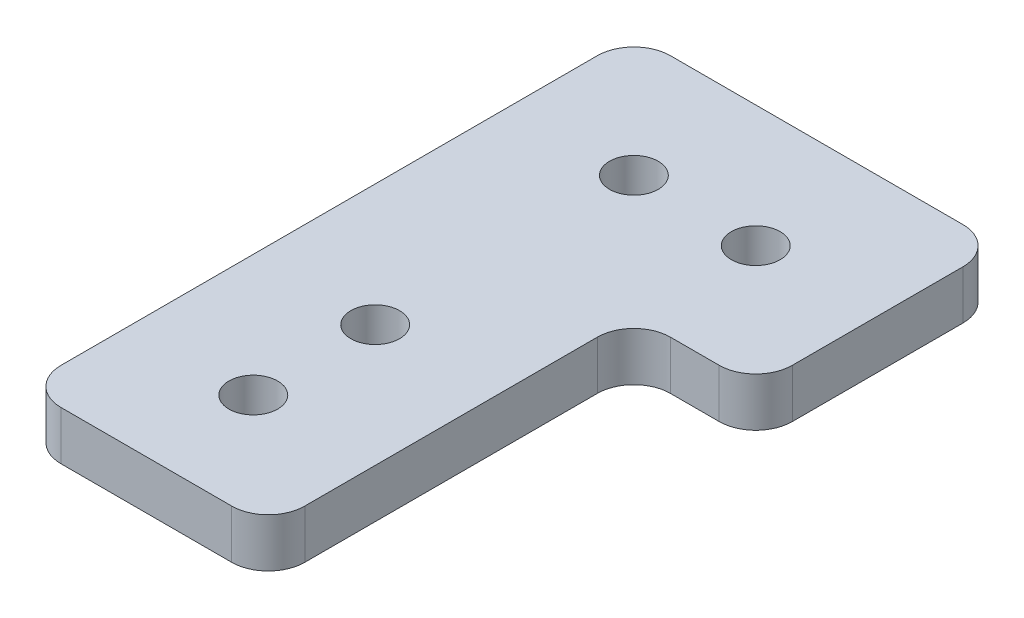
ISO-10303-21;
HEADER;
FILE_DESCRIPTION(('STEP AP214'),'2;1');
FILE_NAME('part.step','',(''),(''),'','','');
FILE_SCHEMA(('AUTOMOTIVE_DESIGN { 1 0 10303 214 1 1 1 1 }'));
ENDSEC;
DATA;
#1=APPLICATION_CONTEXT('core data for automotive mechanical design processes');
#2=APPLICATION_PROTOCOL_DEFINITION('international standard','automotive_design',2000,#1);
#3=PRODUCT_CONTEXT('',#1,'mechanical');
#4=PRODUCT('Part','Part','',(#3));
#5=PRODUCT_RELATED_PRODUCT_CATEGORY('part','',(#4));
#6=PRODUCT_DEFINITION_FORMATION('','',#4);
#7=PRODUCT_DEFINITION_CONTEXT('part definition',#1,'design');
#8=PRODUCT_DEFINITION('design','',#6,#7);
#9=PRODUCT_DEFINITION_SHAPE('','',#8);
#10=(LENGTH_UNIT() NAMED_UNIT(*) SI_UNIT(.MILLI.,.METRE.));
#11=(NAMED_UNIT(*) PLANE_ANGLE_UNIT() SI_UNIT($,.RADIAN.));
#12=(NAMED_UNIT(*) SI_UNIT($,.STERADIAN.) SOLID_ANGLE_UNIT());
#13=UNCERTAINTY_MEASURE_WITH_UNIT(LENGTH_MEASURE(1.E-05),#10,'distance_accuracy_value','');
#14=(GEOMETRIC_REPRESENTATION_CONTEXT(3) GLOBAL_UNCERTAINTY_ASSIGNED_CONTEXT((#13)) GLOBAL_UNIT_ASSIGNED_CONTEXT((#10,
#11,#12)) REPRESENTATION_CONTEXT('',''));
#15=CARTESIAN_POINT('',(0.,0.,0.));
#16=DIRECTION('',(0.,0.,1.));
#17=DIRECTION('',(1.,0.,0.));
#18=AXIS2_PLACEMENT_3D('',#15,#16,#17);
#19=CARTESIAN_POINT('',(0.,4.,0.));
#20=DIRECTION('',(0.,1.,0.));
#21=DIRECTION('',(0.,0.,1.));
#22=AXIS2_PLACEMENT_3D('',#19,#20,#21);
#23=PLANE('',#22);
#24=CARTESIAN_POINT('',(20.,4.,-40.));
#25=DIRECTION('',(0.,1.,0.));
#26=DIRECTION('',(0.,0.,1.));
#27=AXIS2_PLACEMENT_3D('',#24,#25,#26);
#28=CIRCLE('',#27,2.00000000000001);
#29=CARTESIAN_POINT('',(20.,4.,-38.));
#30=VERTEX_POINT('',#29);
#31=EDGE_CURVE('E244',#30,#30,#28,.T.);
#32=ORIENTED_EDGE('',*,*,#31,.F.);
#33=EDGE_LOOP('',(#32));
#34=FACE_BOUND('',#33,.T.);
#35=CARTESIAN_POINT('',(10.,4.,-18.7732277592817));
#36=DIRECTION('',(0.,1.,0.));
#37=DIRECTION('',(0.,0.,1.));
#38=AXIS2_PLACEMENT_3D('',#35,#36,#37);
#39=CIRCLE('',#38,2.);
#40=CARTESIAN_POINT('',(10.,4.,-16.7732277592817));
#41=VERTEX_POINT('',#40);
#42=EDGE_CURVE('E152',#41,#41,#39,.T.);
#43=ORIENTED_EDGE('',*,*,#42,.F.);
#44=EDGE_LOOP('',(#43));
#45=FACE_BOUND('',#44,.T.);
#46=DIRECTION('',(-1.,0.,0.));
#47=VECTOR('',#46,1.);
#48=CARTESIAN_POINT('',(30.,4.,-50.));
#49=LINE('',#48,#47);
#50=CARTESIAN_POINT('',(27.,4.,-50.));
#51=VERTEX_POINT('',#50);
#52=CARTESIAN_POINT('',(3.,4.,-50.));
#53=VERTEX_POINT('',#52);
#54=EDGE_CURVE('E161',#51,#53,#49,.T.);
#55=ORIENTED_EDGE('',*,*,#54,.T.);
#56=CARTESIAN_POINT('',(3.,4.,-47.));
#57=DIRECTION('',(0.,1.,0.));
#58=DIRECTION('',(0.,0.,1.));
#59=AXIS2_PLACEMENT_3D('',#56,#57,#58);
#60=CIRCLE('',#59,3.);
#61=CARTESIAN_POINT('',(0.,4.,-47.));
#62=VERTEX_POINT('',#61);
#63=EDGE_CURVE('E190',#53,#62,#60,.T.);
#64=ORIENTED_EDGE('',*,*,#63,.T.);
#65=DIRECTION('',(0.,0.,1.));
#66=VECTOR('',#65,1.);
#67=CARTESIAN_POINT('',(0.,4.,-50.));
#68=LINE('',#67,#66);
#69=CARTESIAN_POINT('',(0.,4.,-3.));
#70=VERTEX_POINT('',#69);
#71=EDGE_CURVE('E144',#62,#70,#68,.T.);
#72=ORIENTED_EDGE('',*,*,#71,.T.);
#73=CARTESIAN_POINT('',(3.,4.,-3.));
#74=DIRECTION('',(0.,1.,0.));
#75=DIRECTION('',(0.,0.,1.));
#76=AXIS2_PLACEMENT_3D('',#73,#74,#75);
#77=CIRCLE('',#76,3.);
#78=CARTESIAN_POINT('',(3.,4.,0.));
#79=VERTEX_POINT('',#78);
#80=EDGE_CURVE('E183',#70,#79,#77,.T.);
#81=ORIENTED_EDGE('',*,*,#80,.T.);
#82=DIRECTION('',(1.,0.,0.));
#83=VECTOR('',#82,1.);
#84=CARTESIAN_POINT('',(0.,4.,0.));
#85=LINE('',#84,#83);
#86=CARTESIAN_POINT('',(17.,4.,0.));
#87=VERTEX_POINT('',#86);
#88=EDGE_CURVE('E232',#79,#87,#85,.T.);
#89=ORIENTED_EDGE('',*,*,#88,.T.);
#90=CARTESIAN_POINT('',(17.,4.,-3.));
#91=DIRECTION('',(0.,1.,0.));
#92=DIRECTION('',(0.,0.,1.));
#93=AXIS2_PLACEMENT_3D('',#90,#91,#92);
#94=CIRCLE('',#93,3.);
#95=CARTESIAN_POINT('',(20.,4.,-3.));
#96=VERTEX_POINT('',#95);
#97=EDGE_CURVE('E185',#87,#96,#94,.T.);
#98=ORIENTED_EDGE('',*,*,#97,.T.);
#99=DIRECTION('',(0.,0.,-1.));
#100=VECTOR('',#99,1.);
#101=CARTESIAN_POINT('',(20.,4.,0.));
#102=LINE('',#101,#100);
#103=CARTESIAN_POINT('',(20.,4.,-27.));
#104=VERTEX_POINT('',#103);
#105=EDGE_CURVE('E226',#96,#104,#102,.T.);
#106=ORIENTED_EDGE('',*,*,#105,.T.);
#107=CARTESIAN_POINT('',(23.,4.,-27.));
#108=DIRECTION('',(0.,1.,0.));
#109=DIRECTION('',(0.,0.,1.));
#110=AXIS2_PLACEMENT_3D('',#107,#108,#109);
#111=CIRCLE('',#110,3.);
#112=CARTESIAN_POINT('',(23.,4.,-30.));
#113=VERTEX_POINT('',#112);
#114=EDGE_CURVE('E11',#104,#113,#111,.F.);
#115=ORIENTED_EDGE('',*,*,#114,.T.);
#116=DIRECTION('',(1.,0.,0.));
#117=VECTOR('',#116,1.);
#118=CARTESIAN_POINT('',(20.,4.,-30.));
#119=LINE('',#118,#117);
#120=CARTESIAN_POINT('',(27.,4.,-30.));
#121=VERTEX_POINT('',#120);
#122=EDGE_CURVE('E225',#113,#121,#119,.T.);
#123=ORIENTED_EDGE('',*,*,#122,.T.);
#124=CARTESIAN_POINT('',(27.,4.,-33.));
#125=DIRECTION('',(0.,1.,0.));
#126=DIRECTION('',(0.,0.,1.));
#127=AXIS2_PLACEMENT_3D('',#124,#125,#126);
#128=CIRCLE('',#127,3.);
#129=CARTESIAN_POINT('',(30.,4.,-33.));
#130=VERTEX_POINT('',#129);
#131=EDGE_CURVE('E56',#121,#130,#128,.T.);
#132=ORIENTED_EDGE('',*,*,#131,.T.);
#133=DIRECTION('',(0.,0.,-1.));
#134=VECTOR('',#133,1.);
#135=CARTESIAN_POINT('',(30.,4.,-30.));
#136=LINE('',#135,#134);
#137=CARTESIAN_POINT('',(30.,4.,-47.));
#138=VERTEX_POINT('',#137);
#139=EDGE_CURVE('E230',#130,#138,#136,.T.);
#140=ORIENTED_EDGE('',*,*,#139,.T.);
#141=CARTESIAN_POINT('',(27.,4.,-47.));
#142=DIRECTION('',(0.,1.,0.));
#143=DIRECTION('',(0.,0.,1.));
#144=AXIS2_PLACEMENT_3D('',#141,#142,#143);
#145=CIRCLE('',#144,3.);
#146=EDGE_CURVE('E188',#138,#51,#145,.T.);
#147=ORIENTED_EDGE('',*,*,#146,.T.);
#148=EDGE_LOOP('',(#55,#64,#72,#81,#89,#98,#106,#115,#123,#132,#140,#147));
#149=FACE_BOUND('',#148,.T.);
#150=CARTESIAN_POINT('',(10.,4.,-8.77322775928174));
#151=DIRECTION('',(0.,1.,0.));
#152=DIRECTION('',(0.,0.,1.));
#153=AXIS2_PLACEMENT_3D('',#150,#151,#152);
#154=CIRCLE('',#153,2.);
#155=CARTESIAN_POINT('',(10.,4.,-6.77322775928174));
#156=VERTEX_POINT('',#155);
#157=EDGE_CURVE('E239',#156,#156,#154,.T.);
#158=ORIENTED_EDGE('',*,*,#157,.F.);
#159=EDGE_LOOP('',(#158));
#160=FACE_BOUND('',#159,.T.);
#161=CARTESIAN_POINT('',(10.,4.,-40.));
#162=DIRECTION('',(0.,1.,0.));
#163=DIRECTION('',(0.,0.,1.));
#164=AXIS2_PLACEMENT_3D('',#161,#162,#163);
#165=CIRCLE('',#164,2.);
#166=CARTESIAN_POINT('',(10.,4.,-38.));
#167=VERTEX_POINT('',#166);
#168=EDGE_CURVE('E250',#167,#167,#165,.T.);
#169=ORIENTED_EDGE('',*,*,#168,.F.);
#170=EDGE_LOOP('',(#169));
#171=FACE_BOUND('',#170,.T.);
#172=ADVANCED_FACE('F34',(#34,#45,#149,#160,#171),#23,.T.);
#173=CARTESIAN_POINT('',(0.,0.,0.));
#174=DIRECTION('',(0.,1.,0.));
#175=DIRECTION('',(0.,0.,1.));
#176=AXIS2_PLACEMENT_3D('',#173,#174,#175);
#177=PLANE('',#176);
#178=DIRECTION('',(0.,0.,1.));
#179=VECTOR('',#178,1.);
#180=CARTESIAN_POINT('',(0.,0.,-50.));
#181=LINE('',#180,#179);
#182=CARTESIAN_POINT('',(0.,0.,-47.));
#183=VERTEX_POINT('',#182);
#184=CARTESIAN_POINT('',(0.,0.,-3.));
#185=VERTEX_POINT('',#184);
#186=EDGE_CURVE('E141',#183,#185,#181,.T.);
#187=ORIENTED_EDGE('',*,*,#186,.F.);
#188=CARTESIAN_POINT('',(3.,0.,-47.));
#189=DIRECTION('',(0.,1.,0.));
#190=DIRECTION('',(0.,0.,1.));
#191=AXIS2_PLACEMENT_3D('',#188,#189,#190);
#192=CIRCLE('',#191,3.);
#193=CARTESIAN_POINT('',(3.,0.,-50.));
#194=VERTEX_POINT('',#193);
#195=EDGE_CURVE('E124',#183,#194,#192,.F.);
#196=ORIENTED_EDGE('',*,*,#195,.T.);
#197=DIRECTION('',(-1.,0.,0.));
#198=VECTOR('',#197,1.);
#199=CARTESIAN_POINT('',(30.,0.,-50.));
#200=LINE('',#199,#198);
#201=CARTESIAN_POINT('',(27.,0.,-50.));
#202=VERTEX_POINT('',#201);
#203=EDGE_CURVE('E171',#202,#194,#200,.T.);
#204=ORIENTED_EDGE('',*,*,#203,.F.);
#205=CARTESIAN_POINT('',(27.,0.,-47.));
#206=DIRECTION('',(0.,1.,0.));
#207=DIRECTION('',(0.,0.,1.));
#208=AXIS2_PLACEMENT_3D('',#205,#206,#207);
#209=CIRCLE('',#208,3.);
#210=CARTESIAN_POINT('',(30.,0.,-47.));
#211=VERTEX_POINT('',#210);
#212=EDGE_CURVE('E135',#202,#211,#209,.F.);
#213=ORIENTED_EDGE('',*,*,#212,.T.);
#214=DIRECTION('',(0.,0.,-1.));
#215=VECTOR('',#214,1.);
#216=CARTESIAN_POINT('',(30.,0.,-30.));
#217=LINE('',#216,#215);
#218=CARTESIAN_POINT('',(30.,0.,-33.));
#219=VERTEX_POINT('',#218);
#220=EDGE_CURVE('E169',#219,#211,#217,.T.);
#221=ORIENTED_EDGE('',*,*,#220,.F.);
#222=CARTESIAN_POINT('',(27.,0.,-33.));
#223=DIRECTION('',(0.,1.,0.));
#224=DIRECTION('',(0.,0.,1.));
#225=AXIS2_PLACEMENT_3D('',#222,#223,#224);
#226=CIRCLE('',#225,3.);
#227=CARTESIAN_POINT('',(27.,0.,-30.));
#228=VERTEX_POINT('',#227);
#229=EDGE_CURVE('E177',#219,#228,#226,.F.);
#230=ORIENTED_EDGE('',*,*,#229,.T.);
#231=DIRECTION('',(1.,0.,0.));
#232=VECTOR('',#231,1.);
#233=CARTESIAN_POINT('',(20.,0.,-30.));
#234=LINE('',#233,#232);
#235=CARTESIAN_POINT('',(23.,0.,-30.));
#236=VERTEX_POINT('',#235);
#237=EDGE_CURVE('E166',#236,#228,#234,.T.);
#238=ORIENTED_EDGE('',*,*,#237,.F.);
#239=CARTESIAN_POINT('',(23.,0.,-27.));
#240=DIRECTION('',(0.,1.,0.));
#241=DIRECTION('',(0.,0.,1.));
#242=AXIS2_PLACEMENT_3D('',#239,#240,#241);
#243=CIRCLE('',#242,3.);
#244=CARTESIAN_POINT('',(20.,0.,-27.));
#245=VERTEX_POINT('',#244);
#246=EDGE_CURVE('E42',#236,#245,#243,.T.);
#247=ORIENTED_EDGE('',*,*,#246,.T.);
#248=DIRECTION('',(0.,0.,-1.));
#249=VECTOR('',#248,1.);
#250=CARTESIAN_POINT('',(20.,0.,0.));
#251=LINE('',#250,#249);
#252=CARTESIAN_POINT('',(20.,0.,-3.));
#253=VERTEX_POINT('',#252);
#254=EDGE_CURVE('E155',#253,#245,#251,.T.);
#255=ORIENTED_EDGE('',*,*,#254,.F.);
#256=CARTESIAN_POINT('',(17.,0.,-3.));
#257=DIRECTION('',(0.,1.,0.));
#258=DIRECTION('',(0.,0.,1.));
#259=AXIS2_PLACEMENT_3D('',#256,#257,#258);
#260=CIRCLE('',#259,3.);
#261=CARTESIAN_POINT('',(17.,0.,0.));
#262=VERTEX_POINT('',#261);
#263=EDGE_CURVE('E175',#253,#262,#260,.F.);
#264=ORIENTED_EDGE('',*,*,#263,.T.);
#265=DIRECTION('',(1.,0.,0.));
#266=VECTOR('',#265,1.);
#267=CARTESIAN_POINT('',(0.,0.,0.));
#268=LINE('',#267,#266);
#269=CARTESIAN_POINT('',(3.,0.,0.));
#270=VERTEX_POINT('',#269);
#271=EDGE_CURVE('E151',#270,#262,#268,.T.);
#272=ORIENTED_EDGE('',*,*,#271,.F.);
#273=CARTESIAN_POINT('',(3.,0.,-3.));
#274=DIRECTION('',(0.,1.,0.));
#275=DIRECTION('',(0.,0.,1.));
#276=AXIS2_PLACEMENT_3D('',#273,#274,#275);
#277=CIRCLE('',#276,3.);
#278=EDGE_CURVE('E145',#270,#185,#277,.F.);
#279=ORIENTED_EDGE('',*,*,#278,.T.);
#280=EDGE_LOOP('',(#187,#196,#204,#213,#221,#230,#238,#247,#255,#264,#272,#279));
#281=FACE_BOUND('',#280,.T.);
#282=CARTESIAN_POINT('',(10.,0.,-18.7732277592817));
#283=DIRECTION('',(0.,1.,0.));
#284=DIRECTION('',(0.,0.,1.));
#285=AXIS2_PLACEMENT_3D('',#282,#283,#284);
#286=CIRCLE('',#285,2.);
#287=CARTESIAN_POINT('',(10.,0.,-16.7732277592817));
#288=VERTEX_POINT('',#287);
#289=EDGE_CURVE('E158',#288,#288,#286,.T.);
#290=ORIENTED_EDGE('',*,*,#289,.T.);
#291=EDGE_LOOP('',(#290));
#292=FACE_BOUND('',#291,.T.);
#293=CARTESIAN_POINT('',(10.,0.,-8.77322775928174));
#294=DIRECTION('',(0.,1.,0.));
#295=DIRECTION('',(0.,0.,1.));
#296=AXIS2_PLACEMENT_3D('',#293,#294,#295);
#297=CIRCLE('',#296,2.);
#298=CARTESIAN_POINT('',(10.,0.,-6.77322775928174));
#299=VERTEX_POINT('',#298);
#300=EDGE_CURVE('E241',#299,#299,#297,.T.);
#301=ORIENTED_EDGE('',*,*,#300,.T.);
#302=EDGE_LOOP('',(#301));
#303=FACE_BOUND('',#302,.T.);
#304=CARTESIAN_POINT('',(20.,0.,-40.));
#305=DIRECTION('',(0.,1.,0.));
#306=DIRECTION('',(0.,0.,1.));
#307=AXIS2_PLACEMENT_3D('',#304,#305,#306);
#308=CIRCLE('',#307,2.00000000000001);
#309=CARTESIAN_POINT('',(20.,0.,-38.));
#310=VERTEX_POINT('',#309);
#311=EDGE_CURVE('E247',#310,#310,#308,.T.);
#312=ORIENTED_EDGE('',*,*,#311,.T.);
#313=EDGE_LOOP('',(#312));
#314=FACE_BOUND('',#313,.T.);
#315=CARTESIAN_POINT('',(10.,0.,-40.));
#316=DIRECTION('',(0.,1.,0.));
#317=DIRECTION('',(0.,0.,1.));
#318=AXIS2_PLACEMENT_3D('',#315,#316,#317);
#319=CIRCLE('',#318,2.);
#320=CARTESIAN_POINT('',(10.,0.,-38.));
#321=VERTEX_POINT('',#320);
#322=EDGE_CURVE('E253',#321,#321,#319,.T.);
#323=ORIENTED_EDGE('',*,*,#322,.T.);
#324=EDGE_LOOP('',(#323));
#325=FACE_BOUND('',#324,.T.);
#326=ADVANCED_FACE('F148',(#281,#292,#303,#314,#325),#177,.F.);
#327=CARTESIAN_POINT('',(0.,4.,-50.));
#328=DIRECTION('',(1.,0.,0.));
#329=DIRECTION('',(0.,0.,-1.));
#330=AXIS2_PLACEMENT_3D('',#327,#328,#329);
#331=PLANE('',#330);
#332=ORIENTED_EDGE('',*,*,#71,.F.);
#333=DIRECTION('',(0.,-1.,0.));
#334=VECTOR('',#333,1.);
#335=CARTESIAN_POINT('',(0.,4.,-47.));
#336=LINE('',#335,#334);
#337=EDGE_CURVE('E128',#62,#183,#336,.T.);
#338=ORIENTED_EDGE('',*,*,#337,.T.);
#339=ORIENTED_EDGE('',*,*,#186,.T.);
#340=DIRECTION('',(0.,-1.,0.));
#341=VECTOR('',#340,1.);
#342=CARTESIAN_POINT('',(0.,4.,-3.));
#343=LINE('',#342,#341);
#344=EDGE_CURVE('E146',#185,#70,#343,.F.);
#345=ORIENTED_EDGE('',*,*,#344,.T.);
#346=EDGE_LOOP('',(#332,#338,#339,#345));
#347=FACE_BOUND('',#346,.T.);
#348=ADVANCED_FACE('F140',(#347),#331,.F.);
#349=CARTESIAN_POINT('',(0.,4.,0.));
#350=DIRECTION('',(0.,0.,-1.));
#351=DIRECTION('',(-1.,0.,0.));
#352=AXIS2_PLACEMENT_3D('',#349,#350,#351);
#353=PLANE('',#352);
#354=ORIENTED_EDGE('',*,*,#271,.T.);
#355=DIRECTION('',(0.,-1.,0.));
#356=VECTOR('',#355,1.);
#357=CARTESIAN_POINT('',(17.,4.,0.));
#358=LINE('',#357,#356);
#359=EDGE_CURVE('E209',#262,#87,#358,.F.);
#360=ORIENTED_EDGE('',*,*,#359,.T.);
#361=ORIENTED_EDGE('',*,*,#88,.F.);
#362=DIRECTION('',(0.,-1.,0.));
#363=VECTOR('',#362,1.);
#364=CARTESIAN_POINT('',(3.,4.,0.));
#365=LINE('',#364,#363);
#366=EDGE_CURVE('E206',#79,#270,#365,.T.);
#367=ORIENTED_EDGE('',*,*,#366,.T.);
#368=EDGE_LOOP('',(#354,#360,#361,#367));
#369=FACE_BOUND('',#368,.T.);
#370=ADVANCED_FACE('F286',(#369),#353,.F.);
#371=CARTESIAN_POINT('',(20.,4.,0.));
#372=DIRECTION('',(-1.,0.,0.));
#373=DIRECTION('',(0.,0.,1.));
#374=AXIS2_PLACEMENT_3D('',#371,#372,#373);
#375=PLANE('',#374);
#376=ORIENTED_EDGE('',*,*,#254,.T.);
#377=DIRECTION('',(0.,-1.,0.));
#378=VECTOR('',#377,1.);
#379=CARTESIAN_POINT('',(20.,4.,-27.));
#380=LINE('',#379,#378);
#381=EDGE_CURVE('E204',#245,#104,#380,.F.);
#382=ORIENTED_EDGE('',*,*,#381,.T.);
#383=ORIENTED_EDGE('',*,*,#105,.F.);
#384=DIRECTION('',(0.,-1.,0.));
#385=VECTOR('',#384,1.);
#386=CARTESIAN_POINT('',(20.,4.,-3.));
#387=LINE('',#386,#385);
#388=EDGE_CURVE('E201',#96,#253,#387,.T.);
#389=ORIENTED_EDGE('',*,*,#388,.T.);
#390=EDGE_LOOP('',(#376,#382,#383,#389));
#391=FACE_BOUND('',#390,.T.);
#392=ADVANCED_FACE('F216',(#391),#375,.F.);
#393=CARTESIAN_POINT('',(20.,4.,-30.));
#394=DIRECTION('',(0.,0.,-1.));
#395=DIRECTION('',(-1.,0.,0.));
#396=AXIS2_PLACEMENT_3D('',#393,#394,#395);
#397=PLANE('',#396);
#398=ORIENTED_EDGE('',*,*,#237,.T.);
#399=DIRECTION('',(0.,-1.,0.));
#400=VECTOR('',#399,1.);
#401=CARTESIAN_POINT('',(27.,4.,-30.));
#402=LINE('',#401,#400);
#403=EDGE_CURVE('E199',#228,#121,#402,.F.);
#404=ORIENTED_EDGE('',*,*,#403,.T.);
#405=ORIENTED_EDGE('',*,*,#122,.F.);
#406=DIRECTION('',(0.,-1.,0.));
#407=VECTOR('',#406,1.);
#408=CARTESIAN_POINT('',(23.,0.,-30.));
#409=LINE('',#408,#407);
#410=EDGE_CURVE('E196',#113,#236,#409,.T.);
#411=ORIENTED_EDGE('',*,*,#410,.T.);
#412=EDGE_LOOP('',(#398,#404,#405,#411));
#413=FACE_BOUND('',#412,.T.);
#414=ADVANCED_FACE('F228',(#413),#397,.F.);
#415=CARTESIAN_POINT('',(30.,4.,-30.));
#416=DIRECTION('',(-1.,0.,0.));
#417=DIRECTION('',(0.,0.,1.));
#418=AXIS2_PLACEMENT_3D('',#415,#416,#417);
#419=PLANE('',#418);
#420=ORIENTED_EDGE('',*,*,#220,.T.);
#421=DIRECTION('',(0.,-1.,0.));
#422=VECTOR('',#421,1.);
#423=CARTESIAN_POINT('',(30.,4.,-47.));
#424=LINE('',#423,#422);
#425=EDGE_CURVE('E49',#211,#138,#424,.F.);
#426=ORIENTED_EDGE('',*,*,#425,.T.);
#427=ORIENTED_EDGE('',*,*,#139,.F.);
#428=DIRECTION('',(0.,-1.,0.));
#429=VECTOR('',#428,1.);
#430=CARTESIAN_POINT('',(30.,4.,-33.));
#431=LINE('',#430,#429);
#432=EDGE_CURVE('E192',#130,#219,#431,.T.);
#433=ORIENTED_EDGE('',*,*,#432,.T.);
#434=EDGE_LOOP('',(#420,#426,#427,#433));
#435=FACE_BOUND('',#434,.T.);
#436=ADVANCED_FACE('F278',(#435),#419,.F.);
#437=CARTESIAN_POINT('',(30.,4.,-50.));
#438=DIRECTION('',(0.,0.,1.));
#439=DIRECTION('',(1.,0.,0.));
#440=AXIS2_PLACEMENT_3D('',#437,#438,#439);
#441=PLANE('',#440);
#442=ORIENTED_EDGE('',*,*,#203,.T.);
#443=DIRECTION('',(0.,-1.,0.));
#444=VECTOR('',#443,1.);
#445=CARTESIAN_POINT('',(3.,4.,-50.));
#446=LINE('',#445,#444);
#447=EDGE_CURVE('E129',#194,#53,#446,.F.);
#448=ORIENTED_EDGE('',*,*,#447,.T.);
#449=ORIENTED_EDGE('',*,*,#54,.F.);
#450=DIRECTION('',(0.,-1.,0.));
#451=VECTOR('',#450,1.);
#452=CARTESIAN_POINT('',(27.,4.,-50.));
#453=LINE('',#452,#451);
#454=EDGE_CURVE('E134',#51,#202,#453,.T.);
#455=ORIENTED_EDGE('',*,*,#454,.T.);
#456=EDGE_LOOP('',(#442,#448,#449,#455));
#457=FACE_BOUND('',#456,.T.);
#458=ADVANCED_FACE('F275',(#457),#441,.F.);
#459=CARTESIAN_POINT('',(10.,4.,-18.7732277592817));
#460=DIRECTION('',(0.,-1.,0.));
#461=DIRECTION('',(0.,0.,-1.));
#462=AXIS2_PLACEMENT_3D('',#459,#460,#461);
#463=CYLINDRICAL_SURFACE('',#462,2.);
#464=ORIENTED_EDGE('',*,*,#42,.T.);
#465=EDGE_LOOP('',(#464));
#466=FACE_BOUND('',#465,.T.);
#467=ORIENTED_EDGE('',*,*,#289,.F.);
#468=EDGE_LOOP('',(#467));
#469=FACE_BOUND('',#468,.T.);
#470=ADVANCED_FACE('F272',(#466,#469),#463,.F.);
#471=CARTESIAN_POINT('',(10.,4.,-8.77322775928174));
#472=DIRECTION('',(0.,-1.,0.));
#473=DIRECTION('',(0.,0.,-1.));
#474=AXIS2_PLACEMENT_3D('',#471,#472,#473);
#475=CYLINDRICAL_SURFACE('',#474,2.);
#476=ORIENTED_EDGE('',*,*,#157,.T.);
#477=EDGE_LOOP('',(#476));
#478=FACE_BOUND('',#477,.T.);
#479=ORIENTED_EDGE('',*,*,#300,.F.);
#480=EDGE_LOOP('',(#479));
#481=FACE_BOUND('',#480,.T.);
#482=ADVANCED_FACE('F416',(#478,#481),#475,.F.);
#483=CARTESIAN_POINT('',(20.,4.,-40.));
#484=DIRECTION('',(0.,-1.,0.));
#485=DIRECTION('',(0.,0.,-1.));
#486=AXIS2_PLACEMENT_3D('',#483,#484,#485);
#487=CYLINDRICAL_SURFACE('',#486,2.00000000000001);
#488=ORIENTED_EDGE('',*,*,#31,.T.);
#489=EDGE_LOOP('',(#488));
#490=FACE_BOUND('',#489,.T.);
#491=ORIENTED_EDGE('',*,*,#311,.F.);
#492=EDGE_LOOP('',(#491));
#493=FACE_BOUND('',#492,.T.);
#494=ADVANCED_FACE('F407',(#490,#493),#487,.F.);
#495=CARTESIAN_POINT('',(10.,4.,-40.));
#496=DIRECTION('',(0.,-1.,0.));
#497=DIRECTION('',(0.,0.,-1.));
#498=AXIS2_PLACEMENT_3D('',#495,#496,#497);
#499=CYLINDRICAL_SURFACE('',#498,2.);
#500=ORIENTED_EDGE('',*,*,#168,.T.);
#501=EDGE_LOOP('',(#500));
#502=FACE_BOUND('',#501,.T.);
#503=ORIENTED_EDGE('',*,*,#322,.F.);
#504=EDGE_LOOP('',(#503));
#505=FACE_BOUND('',#504,.T.);
#506=ADVANCED_FACE('F259',(#502,#505),#499,.F.);
#507=CARTESIAN_POINT('',(3.,4.,-47.));
#508=DIRECTION('',(0.,-1.,0.));
#509=DIRECTION('',(0.,0.,-1.));
#510=AXIS2_PLACEMENT_3D('',#507,#508,#509);
#511=CYLINDRICAL_SURFACE('',#510,3.);
#512=ORIENTED_EDGE('',*,*,#63,.F.);
#513=ORIENTED_EDGE('',*,*,#447,.F.);
#514=ORIENTED_EDGE('',*,*,#195,.F.);
#515=ORIENTED_EDGE('',*,*,#337,.F.);
#516=EDGE_LOOP('',(#512,#513,#514,#515));
#517=FACE_BOUND('',#516,.T.);
#518=ADVANCED_FACE('F127',(#517),#511,.T.);
#519=CARTESIAN_POINT('',(27.,4.,-47.));
#520=DIRECTION('',(0.,-1.,0.));
#521=DIRECTION('',(0.,0.,-1.));
#522=AXIS2_PLACEMENT_3D('',#519,#520,#521);
#523=CYLINDRICAL_SURFACE('',#522,3.);
#524=ORIENTED_EDGE('',*,*,#146,.F.);
#525=ORIENTED_EDGE('',*,*,#425,.F.);
#526=ORIENTED_EDGE('',*,*,#212,.F.);
#527=ORIENTED_EDGE('',*,*,#454,.F.);
#528=EDGE_LOOP('',(#524,#525,#526,#527));
#529=FACE_BOUND('',#528,.T.);
#530=ADVANCED_FACE('F294',(#529),#523,.T.);
#531=CARTESIAN_POINT('',(27.,4.,-33.));
#532=DIRECTION('',(0.,-1.,0.));
#533=DIRECTION('',(0.,0.,-1.));
#534=AXIS2_PLACEMENT_3D('',#531,#532,#533);
#535=CYLINDRICAL_SURFACE('',#534,3.);
#536=ORIENTED_EDGE('',*,*,#131,.F.);
#537=ORIENTED_EDGE('',*,*,#403,.F.);
#538=ORIENTED_EDGE('',*,*,#229,.F.);
#539=ORIENTED_EDGE('',*,*,#432,.F.);
#540=EDGE_LOOP('',(#536,#537,#538,#539));
#541=FACE_BOUND('',#540,.T.);
#542=ADVANCED_FACE('F297',(#541),#535,.T.);
#543=CARTESIAN_POINT('',(23.,4.,-27.));
#544=DIRECTION('',(0.,1.,0.));
#545=DIRECTION('',(0.,0.,1.));
#546=AXIS2_PLACEMENT_3D('',#543,#544,#545);
#547=CYLINDRICAL_SURFACE('',#546,3.);
#548=ORIENTED_EDGE('',*,*,#114,.F.);
#549=ORIENTED_EDGE('',*,*,#381,.F.);
#550=ORIENTED_EDGE('',*,*,#246,.F.);
#551=ORIENTED_EDGE('',*,*,#410,.F.);
#552=EDGE_LOOP('',(#548,#549,#550,#551));
#553=FACE_BOUND('',#552,.T.);
#554=ADVANCED_FACE('F221',(#553),#547,.F.);
#555=CARTESIAN_POINT('',(17.,4.,-3.));
#556=DIRECTION('',(0.,-1.,0.));
#557=DIRECTION('',(0.,0.,-1.));
#558=AXIS2_PLACEMENT_3D('',#555,#556,#557);
#559=CYLINDRICAL_SURFACE('',#558,3.);
#560=ORIENTED_EDGE('',*,*,#97,.F.);
#561=ORIENTED_EDGE('',*,*,#359,.F.);
#562=ORIENTED_EDGE('',*,*,#263,.F.);
#563=ORIENTED_EDGE('',*,*,#388,.F.);
#564=EDGE_LOOP('',(#560,#561,#562,#563));
#565=FACE_BOUND('',#564,.T.);
#566=ADVANCED_FACE('F303',(#565),#559,.T.);
#567=CARTESIAN_POINT('',(3.,4.,-3.));
#568=DIRECTION('',(0.,-1.,0.));
#569=DIRECTION('',(0.,0.,-1.));
#570=AXIS2_PLACEMENT_3D('',#567,#568,#569);
#571=CYLINDRICAL_SURFACE('',#570,3.);
#572=ORIENTED_EDGE('',*,*,#80,.F.);
#573=ORIENTED_EDGE('',*,*,#344,.F.);
#574=ORIENTED_EDGE('',*,*,#278,.F.);
#575=ORIENTED_EDGE('',*,*,#366,.F.);
#576=EDGE_LOOP('',(#572,#573,#574,#575));
#577=FACE_BOUND('',#576,.T.);
#578=ADVANCED_FACE('F36',(#577),#571,.T.);
#579=CLOSED_SHELL('',(#172,#326,#348,#370,#392,#414,#436,#458,#470,#482,#494,#506,#518,#530,
#542,#554,#566,#578));
#580=MANIFOLD_SOLID_BREP('B2',#579);
#581=ADVANCED_BREP_SHAPE_REPRESENTATION('',(#18,#580),#14);
#582=SHAPE_DEFINITION_REPRESENTATION(#9,#581);
ENDSEC;
END-ISO-10303-21;
